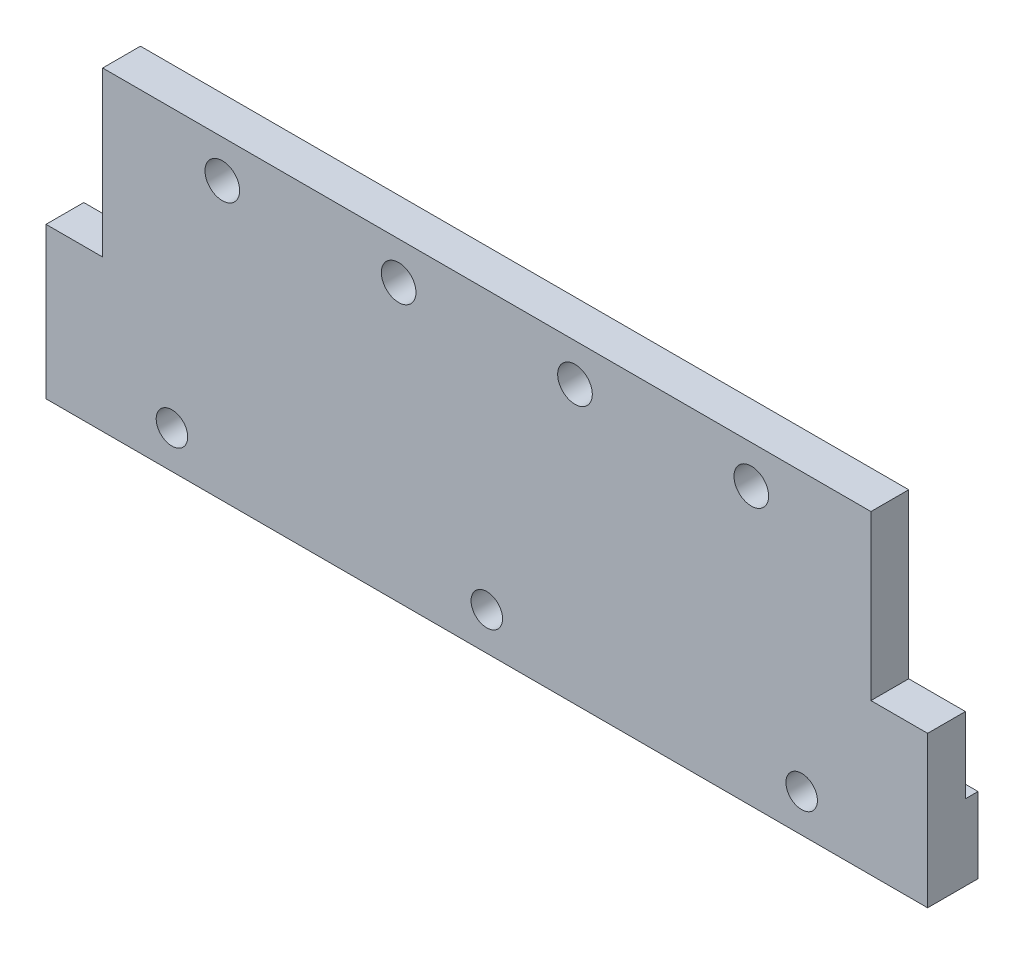
ISO-10303-21;
HEADER;
FILE_DESCRIPTION(('STEP AP214'),'2;1');
FILE_NAME('part.step','',(''),(''),'','','');
FILE_SCHEMA(('AUTOMOTIVE_DESIGN { 1 0 10303 214 1 1 1 1 }'));
ENDSEC;
DATA;
#1=APPLICATION_CONTEXT('core data for automotive mechanical design processes');
#2=APPLICATION_PROTOCOL_DEFINITION('international standard','automotive_design',2000,#1);
#3=PRODUCT_CONTEXT('',#1,'mechanical');
#4=PRODUCT('Part','Part','',(#3));
#5=PRODUCT_RELATED_PRODUCT_CATEGORY('part','',(#4));
#6=PRODUCT_DEFINITION_FORMATION('','',#4);
#7=PRODUCT_DEFINITION_CONTEXT('part definition',#1,'design');
#8=PRODUCT_DEFINITION('design','',#6,#7);
#9=PRODUCT_DEFINITION_SHAPE('','',#8);
#10=(LENGTH_UNIT() NAMED_UNIT(*) SI_UNIT(.MILLI.,.METRE.));
#11=(NAMED_UNIT(*) PLANE_ANGLE_UNIT() SI_UNIT($,.RADIAN.));
#12=(NAMED_UNIT(*) SI_UNIT($,.STERADIAN.) SOLID_ANGLE_UNIT());
#13=UNCERTAINTY_MEASURE_WITH_UNIT(LENGTH_MEASURE(1.E-05),#10,'distance_accuracy_value','');
#14=(GEOMETRIC_REPRESENTATION_CONTEXT(3) GLOBAL_UNCERTAINTY_ASSIGNED_CONTEXT((#13)) GLOBAL_UNIT_ASSIGNED_CONTEXT((#10,
#11,#12)) REPRESENTATION_CONTEXT('',''));
#15=CARTESIAN_POINT('',(0.,0.,0.));
#16=DIRECTION('',(0.,0.,1.));
#17=DIRECTION('',(1.,0.,0.));
#18=AXIS2_PLACEMENT_3D('',#15,#16,#17);
#19=CARTESIAN_POINT('',(70.,-25.,6.));
#20=DIRECTION('',(-1.,0.,0.));
#21=DIRECTION('',(0.,0.,1.));
#22=AXIS2_PLACEMENT_3D('',#19,#20,#21);
#23=PLANE('',#22);
#24=DIRECTION('',(0.,1.,0.));
#25=VECTOR('',#24,1.);
#26=CARTESIAN_POINT('',(70.,-25.,0.));
#27=LINE('',#26,#25);
#28=CARTESIAN_POINT('',(70.,-13.,0.));
#29=VERTEX_POINT('',#28);
#30=CARTESIAN_POINT('',(70.,-0.999999999999997,0.));
#31=VERTEX_POINT('',#30);
#32=EDGE_CURVE('E145',#29,#31,#27,.T.);
#33=ORIENTED_EDGE('',*,*,#32,.T.);
#34=DIRECTION('',(0.,0.,1.));
#35=VECTOR('',#34,1.);
#36=CARTESIAN_POINT('',(70.,-0.999999999999997,-2.000025));
#37=LINE('',#36,#35);
#38=CARTESIAN_POINT('',(70.,-0.999999999999997,6.));
#39=VERTEX_POINT('',#38);
#40=EDGE_CURVE('E217',#31,#39,#37,.T.);
#41=ORIENTED_EDGE('',*,*,#40,.T.);
#42=DIRECTION('',(0.,1.,0.));
#43=VECTOR('',#42,1.);
#44=CARTESIAN_POINT('',(70.,-25.,6.));
#45=LINE('',#44,#43);
#46=CARTESIAN_POINT('',(70.,-25.,6.));
#47=VERTEX_POINT('',#46);
#48=EDGE_CURVE('E130',#47,#39,#45,.T.);
#49=ORIENTED_EDGE('',*,*,#48,.F.);
#50=DIRECTION('',(0.,0.,-1.));
#51=VECTOR('',#50,1.);
#52=CARTESIAN_POINT('',(70.,-25.,6.));
#53=LINE('',#52,#51);
#54=CARTESIAN_POINT('',(70.,-25.,-2.));
#55=VERTEX_POINT('',#54);
#56=EDGE_CURVE('E139',#47,#55,#53,.T.);
#57=ORIENTED_EDGE('',*,*,#56,.T.);
#58=DIRECTION('',(0.,-1.,0.));
#59=VECTOR('',#58,1.);
#60=CARTESIAN_POINT('',(70.,-25.,-2.));
#61=LINE('',#60,#59);
#62=CARTESIAN_POINT('',(70.,-13.,-2.));
#63=VERTEX_POINT('',#62);
#64=EDGE_CURVE('E289',#63,#55,#61,.T.);
#65=ORIENTED_EDGE('',*,*,#64,.F.);
#66=DIRECTION('',(0.,0.,1.));
#67=VECTOR('',#66,1.);
#68=CARTESIAN_POINT('',(70.,-13.,-2.));
#69=LINE('',#68,#67);
#70=EDGE_CURVE('E158',#63,#29,#69,.T.);
#71=ORIENTED_EDGE('',*,*,#70,.T.);
#72=EDGE_LOOP('',(#33,#41,#49,#57,#65,#71));
#73=FACE_BOUND('',#72,.T.);
#74=ADVANCED_FACE('F34',(#73),#23,.F.);
#75=CARTESIAN_POINT('',(-70.,25.,6.));
#76=DIRECTION('',(0.,-1.,0.));
#77=DIRECTION('',(0.,0.,-1.));
#78=AXIS2_PLACEMENT_3D('',#75,#76,#77);
#79=PLANE('',#78);
#80=DIRECTION('',(-1.,0.,0.));
#81=VECTOR('',#80,1.);
#82=CARTESIAN_POINT('',(-70.,25.,6.));
#83=LINE('',#82,#81);
#84=CARTESIAN_POINT('',(61.,25.,6.));
#85=VERTEX_POINT('',#84);
#86=CARTESIAN_POINT('',(-61.,25.,6.));
#87=VERTEX_POINT('',#86);
#88=EDGE_CURVE('E122',#85,#87,#83,.T.);
#89=ORIENTED_EDGE('',*,*,#88,.F.);
#90=DIRECTION('',(0.,0.,1.));
#91=VECTOR('',#90,1.);
#92=CARTESIAN_POINT('',(61.,25.,-2.000025));
#93=LINE('',#92,#91);
#94=CARTESIAN_POINT('',(61.,25.,0.));
#95=VERTEX_POINT('',#94);
#96=EDGE_CURVE('E107',#95,#85,#93,.T.);
#97=ORIENTED_EDGE('',*,*,#96,.F.);
#98=DIRECTION('',(-1.,0.,0.));
#99=VECTOR('',#98,1.);
#100=CARTESIAN_POINT('',(-70.,25.,0.));
#101=LINE('',#100,#99);
#102=CARTESIAN_POINT('',(-61.,25.,0.));
#103=VERTEX_POINT('',#102);
#104=EDGE_CURVE('E142',#95,#103,#101,.T.);
#105=ORIENTED_EDGE('',*,*,#104,.T.);
#106=DIRECTION('',(0.,0.,1.));
#107=VECTOR('',#106,1.);
#108=CARTESIAN_POINT('',(-61.,25.,-2.000025));
#109=LINE('',#108,#107);
#110=EDGE_CURVE('E128',#103,#87,#109,.T.);
#111=ORIENTED_EDGE('',*,*,#110,.T.);
#112=EDGE_LOOP('',(#89,#97,#105,#111));
#113=FACE_BOUND('',#112,.T.);
#114=ADVANCED_FACE('F126',(#113),#79,.F.);
#115=CARTESIAN_POINT('',(-70.,-25.,6.));
#116=DIRECTION('',(1.,0.,0.));
#117=DIRECTION('',(0.,0.,-1.));
#118=AXIS2_PLACEMENT_3D('',#115,#116,#117);
#119=PLANE('',#118);
#120=DIRECTION('',(0.,-1.,0.));
#121=VECTOR('',#120,1.);
#122=CARTESIAN_POINT('',(-70.,-25.,6.));
#123=LINE('',#122,#121);
#124=CARTESIAN_POINT('',(-70.,-0.999999999999997,6.));
#125=VERTEX_POINT('',#124);
#126=CARTESIAN_POINT('',(-70.,-25.,6.));
#127=VERTEX_POINT('',#126);
#128=EDGE_CURVE('E129',#125,#127,#123,.T.);
#129=ORIENTED_EDGE('',*,*,#128,.F.);
#130=DIRECTION('',(0.,0.,1.));
#131=VECTOR('',#130,1.);
#132=CARTESIAN_POINT('',(-70.,-0.999999999999997,-2.000025));
#133=LINE('',#132,#131);
#134=CARTESIAN_POINT('',(-70.,-0.999999999999997,0.));
#135=VERTEX_POINT('',#134);
#136=EDGE_CURVE('E266',#135,#125,#133,.T.);
#137=ORIENTED_EDGE('',*,*,#136,.F.);
#138=DIRECTION('',(0.,-1.,0.));
#139=VECTOR('',#138,1.);
#140=CARTESIAN_POINT('',(-70.,-25.,0.));
#141=LINE('',#140,#139);
#142=CARTESIAN_POINT('',(-70.,-13.,0.));
#143=VERTEX_POINT('',#142);
#144=EDGE_CURVE('E134',#135,#143,#141,.T.);
#145=ORIENTED_EDGE('',*,*,#144,.T.);
#146=DIRECTION('',(0.,0.,1.));
#147=VECTOR('',#146,1.);
#148=CARTESIAN_POINT('',(-70.,-13.,-2.));
#149=LINE('',#148,#147);
#150=CARTESIAN_POINT('',(-70.,-13.,-2.));
#151=VERTEX_POINT('',#150);
#152=EDGE_CURVE('E172',#151,#143,#149,.T.);
#153=ORIENTED_EDGE('',*,*,#152,.F.);
#154=DIRECTION('',(0.,1.,0.));
#155=VECTOR('',#154,1.);
#156=CARTESIAN_POINT('',(-70.,-25.,-2.));
#157=LINE('',#156,#155);
#158=CARTESIAN_POINT('',(-70.,-25.,-2.));
#159=VERTEX_POINT('',#158);
#160=EDGE_CURVE('E156',#159,#151,#157,.T.);
#161=ORIENTED_EDGE('',*,*,#160,.F.);
#162=DIRECTION('',(0.,0.,-1.));
#163=VECTOR('',#162,1.);
#164=CARTESIAN_POINT('',(-70.,-25.,6.));
#165=LINE('',#164,#163);
#166=EDGE_CURVE('E150',#127,#159,#165,.T.);
#167=ORIENTED_EDGE('',*,*,#166,.F.);
#168=EDGE_LOOP('',(#129,#137,#145,#153,#161,#167));
#169=FACE_BOUND('',#168,.T.);
#170=ADVANCED_FACE('F213',(#169),#119,.F.);
#171=CARTESIAN_POINT('',(-70.,-25.,6.));
#172=DIRECTION('',(0.,1.,0.));
#173=DIRECTION('',(0.,0.,1.));
#174=AXIS2_PLACEMENT_3D('',#171,#172,#173);
#175=PLANE('',#174);
#176=ORIENTED_EDGE('',*,*,#166,.T.);
#177=DIRECTION('',(-1.,0.,0.));
#178=VECTOR('',#177,1.);
#179=CARTESIAN_POINT('',(-70.,-25.,-2.));
#180=LINE('',#179,#178);
#181=EDGE_CURVE('E163',#55,#159,#180,.T.);
#182=ORIENTED_EDGE('',*,*,#181,.F.);
#183=ORIENTED_EDGE('',*,*,#56,.F.);
#184=DIRECTION('',(1.,0.,0.));
#185=VECTOR('',#184,1.);
#186=CARTESIAN_POINT('',(-70.,-25.,6.));
#187=LINE('',#186,#185);
#188=EDGE_CURVE('E132',#127,#47,#187,.T.);
#189=ORIENTED_EDGE('',*,*,#188,.F.);
#190=EDGE_LOOP('',(#176,#182,#183,#189));
#191=FACE_BOUND('',#190,.T.);
#192=ADVANCED_FACE('F202',(#191),#175,.F.);
#193=CARTESIAN_POINT('',(70.,25.,6.));
#194=DIRECTION('',(0.,0.,-1.));
#195=DIRECTION('',(-1.,0.,0.));
#196=AXIS2_PLACEMENT_3D('',#193,#194,#195);
#197=PLANE('',#196);
#198=CARTESIAN_POINT('',(0.,-19.,6.));
#199=DIRECTION('',(0.,0.,1.));
#200=DIRECTION('',(1.,0.,0.));
#201=AXIS2_PLACEMENT_3D('',#198,#199,#200);
#202=CIRCLE('',#201,2.5);
#203=CARTESIAN_POINT('',(2.5,-19.,6.));
#204=VERTEX_POINT('',#203);
#205=EDGE_CURVE('E275',#204,#204,#202,.T.);
#206=ORIENTED_EDGE('',*,*,#205,.F.);
#207=EDGE_LOOP('',(#206));
#208=FACE_BOUND('',#207,.T.);
#209=CARTESIAN_POINT('',(-50.,-19.,6.));
#210=DIRECTION('',(0.,0.,1.));
#211=DIRECTION('',(1.,0.,0.));
#212=AXIS2_PLACEMENT_3D('',#209,#210,#211);
#213=CIRCLE('',#212,2.5);
#214=CARTESIAN_POINT('',(-47.5,-19.,6.));
#215=VERTEX_POINT('',#214);
#216=EDGE_CURVE('E246',#215,#215,#213,.T.);
#217=ORIENTED_EDGE('',*,*,#216,.F.);
#218=EDGE_LOOP('',(#217));
#219=FACE_BOUND('',#218,.T.);
#220=CARTESIAN_POINT('',(50.,-19.,6.));
#221=DIRECTION('',(0.,0.,1.));
#222=DIRECTION('',(1.,0.,0.));
#223=AXIS2_PLACEMENT_3D('',#220,#221,#222);
#224=CIRCLE('',#223,2.5);
#225=CARTESIAN_POINT('',(52.5,-19.,6.));
#226=VERTEX_POINT('',#225);
#227=EDGE_CURVE('E241',#226,#226,#224,.T.);
#228=ORIENTED_EDGE('',*,*,#227,.F.);
#229=EDGE_LOOP('',(#228));
#230=FACE_BOUND('',#229,.T.);
#231=CARTESIAN_POINT('',(42.,19.,6.));
#232=DIRECTION('',(0.,0.,-1.));
#233=DIRECTION('',(-1.,0.,0.));
#234=AXIS2_PLACEMENT_3D('',#231,#232,#233);
#235=CIRCLE('',#234,2.75);
#236=CARTESIAN_POINT('',(39.25,19.,6.));
#237=VERTEX_POINT('',#236);
#238=EDGE_CURVE('E165',#237,#237,#235,.T.);
#239=ORIENTED_EDGE('',*,*,#238,.T.);
#240=EDGE_LOOP('',(#239));
#241=FACE_BOUND('',#240,.T.);
#242=CARTESIAN_POINT('',(14.,19.,6.));
#243=DIRECTION('',(0.,0.,-1.));
#244=DIRECTION('',(-1.,0.,0.));
#245=AXIS2_PLACEMENT_3D('',#242,#243,#244);
#246=CIRCLE('',#245,2.75);
#247=CARTESIAN_POINT('',(11.25,19.,6.));
#248=VERTEX_POINT('',#247);
#249=EDGE_CURVE('E173',#248,#248,#246,.T.);
#250=ORIENTED_EDGE('',*,*,#249,.T.);
#251=EDGE_LOOP('',(#250));
#252=FACE_BOUND('',#251,.T.);
#253=CARTESIAN_POINT('',(-14.,19.,6.));
#254=DIRECTION('',(0.,0.,-1.));
#255=DIRECTION('',(-1.,0.,0.));
#256=AXIS2_PLACEMENT_3D('',#253,#254,#255);
#257=CIRCLE('',#256,2.75);
#258=CARTESIAN_POINT('',(-16.75,19.,6.));
#259=VERTEX_POINT('',#258);
#260=EDGE_CURVE('E179',#259,#259,#257,.T.);
#261=ORIENTED_EDGE('',*,*,#260,.T.);
#262=EDGE_LOOP('',(#261));
#263=FACE_BOUND('',#262,.T.);
#264=CARTESIAN_POINT('',(-42.,19.,6.));
#265=DIRECTION('',(0.,0.,-1.));
#266=DIRECTION('',(-1.,0.,0.));
#267=AXIS2_PLACEMENT_3D('',#264,#265,#266);
#268=CIRCLE('',#267,2.75);
#269=CARTESIAN_POINT('',(-44.75,19.,6.));
#270=VERTEX_POINT('',#269);
#271=EDGE_CURVE('E149',#270,#270,#268,.T.);
#272=ORIENTED_EDGE('',*,*,#271,.T.);
#273=EDGE_LOOP('',(#272));
#274=FACE_BOUND('',#273,.T.);
#275=ORIENTED_EDGE('',*,*,#48,.T.);
#276=DIRECTION('',(1.,0.,0.));
#277=VECTOR('',#276,1.);
#278=CARTESIAN_POINT('',(70.,-0.999999999999997,6.));
#279=LINE('',#278,#277);
#280=CARTESIAN_POINT('',(61.,-0.999999999999999,6.));
#281=VERTEX_POINT('',#280);
#282=EDGE_CURVE('E116',#281,#39,#279,.T.);
#283=ORIENTED_EDGE('',*,*,#282,.F.);
#284=DIRECTION('',(0.,-1.,0.));
#285=VECTOR('',#284,1.);
#286=CARTESIAN_POINT('',(61.,25.,6.));
#287=LINE('',#286,#285);
#288=EDGE_CURVE('E110',#85,#281,#287,.T.);
#289=ORIENTED_EDGE('',*,*,#288,.F.);
#290=ORIENTED_EDGE('',*,*,#88,.T.);
#291=DIRECTION('',(0.,1.,0.));
#292=VECTOR('',#291,1.);
#293=CARTESIAN_POINT('',(-61.,25.,6.));
#294=LINE('',#293,#292);
#295=CARTESIAN_POINT('',(-61.,-0.999999999999997,6.));
#296=VERTEX_POINT('',#295);
#297=EDGE_CURVE('E268',#296,#87,#294,.T.);
#298=ORIENTED_EDGE('',*,*,#297,.F.);
#299=DIRECTION('',(1.,0.,0.));
#300=VECTOR('',#299,1.);
#301=CARTESIAN_POINT('',(-70.,-0.999999999999997,6.));
#302=LINE('',#301,#300);
#303=EDGE_CURVE('E271',#125,#296,#302,.T.);
#304=ORIENTED_EDGE('',*,*,#303,.F.);
#305=ORIENTED_EDGE('',*,*,#128,.T.);
#306=ORIENTED_EDGE('',*,*,#188,.T.);
#307=EDGE_LOOP('',(#275,#283,#289,#290,#298,#304,#305,#306));
#308=FACE_BOUND('',#307,.T.);
#309=ADVANCED_FACE('F120',(#208,#219,#230,#241,#252,#263,#274,#308),#197,.F.);
#310=CARTESIAN_POINT('',(70.,25.,0.));
#311=DIRECTION('',(0.,0.,-1.));
#312=DIRECTION('',(-1.,0.,0.));
#313=AXIS2_PLACEMENT_3D('',#310,#311,#312);
#314=PLANE('',#313);
#315=DIRECTION('',(-1.,0.,0.));
#316=VECTOR('',#315,1.);
#317=CARTESIAN_POINT('',(70.,-0.999999999999997,0.));
#318=LINE('',#317,#316);
#319=CARTESIAN_POINT('',(61.,-0.999999999999997,0.));
#320=VERTEX_POINT('',#319);
#321=EDGE_CURVE('E11',#31,#320,#318,.T.);
#322=ORIENTED_EDGE('',*,*,#321,.F.);
#323=ORIENTED_EDGE('',*,*,#32,.F.);
#324=DIRECTION('',(1.,0.,0.));
#325=VECTOR('',#324,1.);
#326=CARTESIAN_POINT('',(-70.,-13.,0.));
#327=LINE('',#326,#325);
#328=EDGE_CURVE('E152',#143,#29,#327,.T.);
#329=ORIENTED_EDGE('',*,*,#328,.F.);
#330=ORIENTED_EDGE('',*,*,#144,.F.);
#331=DIRECTION('',(-1.,0.,0.));
#332=VECTOR('',#331,1.);
#333=CARTESIAN_POINT('',(70.,-0.999999999999997,0.));
#334=LINE('',#333,#332);
#335=CARTESIAN_POINT('',(-61.,-0.999999999999997,0.));
#336=VERTEX_POINT('',#335);
#337=EDGE_CURVE('E249',#336,#135,#334,.T.);
#338=ORIENTED_EDGE('',*,*,#337,.F.);
#339=DIRECTION('',(0.,-1.,0.));
#340=VECTOR('',#339,1.);
#341=CARTESIAN_POINT('',(-61.,25.,0.));
#342=LINE('',#341,#340);
#343=EDGE_CURVE('E259',#103,#336,#342,.T.);
#344=ORIENTED_EDGE('',*,*,#343,.F.);
#345=ORIENTED_EDGE('',*,*,#104,.F.);
#346=DIRECTION('',(0.,1.,0.));
#347=VECTOR('',#346,1.);
#348=CARTESIAN_POINT('',(61.,25.,0.));
#349=LINE('',#348,#347);
#350=EDGE_CURVE('E41',#320,#95,#349,.T.);
#351=ORIENTED_EDGE('',*,*,#350,.F.);
#352=EDGE_LOOP('',(#322,#323,#329,#330,#338,#344,#345,#351));
#353=FACE_BOUND('',#352,.T.);
#354=CARTESIAN_POINT('',(42.,19.,0.));
#355=DIRECTION('',(0.,0.,-1.));
#356=DIRECTION('',(-1.,0.,0.));
#357=AXIS2_PLACEMENT_3D('',#354,#355,#356);
#358=CIRCLE('',#357,2.75);
#359=CARTESIAN_POINT('',(39.25,19.,0.));
#360=VERTEX_POINT('',#359);
#361=EDGE_CURVE('E169',#360,#360,#358,.T.);
#362=ORIENTED_EDGE('',*,*,#361,.F.);
#363=EDGE_LOOP('',(#362));
#364=FACE_BOUND('',#363,.T.);
#365=CARTESIAN_POINT('',(14.,19.,0.));
#366=DIRECTION('',(0.,0.,-1.));
#367=DIRECTION('',(-1.,0.,0.));
#368=AXIS2_PLACEMENT_3D('',#365,#366,#367);
#369=CIRCLE('',#368,2.75);
#370=CARTESIAN_POINT('',(11.25,19.,0.));
#371=VERTEX_POINT('',#370);
#372=EDGE_CURVE('E168',#371,#371,#369,.T.);
#373=ORIENTED_EDGE('',*,*,#372,.F.);
#374=EDGE_LOOP('',(#373));
#375=FACE_BOUND('',#374,.T.);
#376=CARTESIAN_POINT('',(-14.,19.,0.));
#377=DIRECTION('',(0.,0.,-1.));
#378=DIRECTION('',(-1.,0.,0.));
#379=AXIS2_PLACEMENT_3D('',#376,#377,#378);
#380=CIRCLE('',#379,2.75);
#381=CARTESIAN_POINT('',(-16.75,19.,0.));
#382=VERTEX_POINT('',#381);
#383=EDGE_CURVE('E176',#382,#382,#380,.T.);
#384=ORIENTED_EDGE('',*,*,#383,.F.);
#385=EDGE_LOOP('',(#384));
#386=FACE_BOUND('',#385,.T.);
#387=CARTESIAN_POINT('',(-42.,19.,0.));
#388=DIRECTION('',(0.,0.,-1.));
#389=DIRECTION('',(-1.,0.,0.));
#390=AXIS2_PLACEMENT_3D('',#387,#388,#389);
#391=CIRCLE('',#390,2.75);
#392=CARTESIAN_POINT('',(-44.75,19.,0.));
#393=VERTEX_POINT('',#392);
#394=EDGE_CURVE('E182',#393,#393,#391,.T.);
#395=ORIENTED_EDGE('',*,*,#394,.F.);
#396=EDGE_LOOP('',(#395));
#397=FACE_BOUND('',#396,.T.);
#398=ADVANCED_FACE('F191',(#353,#364,#375,#386,#397),#314,.T.);
#399=CARTESIAN_POINT('',(-42.,19.,6.));
#400=DIRECTION('',(0.,0.,-1.));
#401=DIRECTION('',(-1.,0.,0.));
#402=AXIS2_PLACEMENT_3D('',#399,#400,#401);
#403=CYLINDRICAL_SURFACE('',#402,2.75);
#404=ORIENTED_EDGE('',*,*,#271,.F.);
#405=EDGE_LOOP('',(#404));
#406=FACE_BOUND('',#405,.T.);
#407=ORIENTED_EDGE('',*,*,#394,.T.);
#408=EDGE_LOOP('',(#407));
#409=FACE_BOUND('',#408,.T.);
#410=ADVANCED_FACE('F189',(#406,#409),#403,.F.);
#411=CARTESIAN_POINT('',(-14.,19.,6.));
#412=DIRECTION('',(0.,0.,-1.));
#413=DIRECTION('',(-1.,0.,0.));
#414=AXIS2_PLACEMENT_3D('',#411,#412,#413);
#415=CYLINDRICAL_SURFACE('',#414,2.75);
#416=ORIENTED_EDGE('',*,*,#260,.F.);
#417=EDGE_LOOP('',(#416));
#418=FACE_BOUND('',#417,.T.);
#419=ORIENTED_EDGE('',*,*,#383,.T.);
#420=EDGE_LOOP('',(#419));
#421=FACE_BOUND('',#420,.T.);
#422=ADVANCED_FACE('F199',(#418,#421),#415,.F.);
#423=CARTESIAN_POINT('',(14.,19.,6.));
#424=DIRECTION('',(0.,0.,-1.));
#425=DIRECTION('',(-1.,0.,0.));
#426=AXIS2_PLACEMENT_3D('',#423,#424,#425);
#427=CYLINDRICAL_SURFACE('',#426,2.75);
#428=ORIENTED_EDGE('',*,*,#249,.F.);
#429=EDGE_LOOP('',(#428));
#430=FACE_BOUND('',#429,.T.);
#431=ORIENTED_EDGE('',*,*,#372,.T.);
#432=EDGE_LOOP('',(#431));
#433=FACE_BOUND('',#432,.T.);
#434=ADVANCED_FACE('F342',(#430,#433),#427,.F.);
#435=CARTESIAN_POINT('',(42.,19.,6.));
#436=DIRECTION('',(0.,0.,-1.));
#437=DIRECTION('',(-1.,0.,0.));
#438=AXIS2_PLACEMENT_3D('',#435,#436,#437);
#439=CYLINDRICAL_SURFACE('',#438,2.75);
#440=ORIENTED_EDGE('',*,*,#238,.F.);
#441=EDGE_LOOP('',(#440));
#442=FACE_BOUND('',#441,.T.);
#443=ORIENTED_EDGE('',*,*,#361,.T.);
#444=EDGE_LOOP('',(#443));
#445=FACE_BOUND('',#444,.T.);
#446=ADVANCED_FACE('F339',(#442,#445),#439,.F.);
#447=CARTESIAN_POINT('',(-70.,-13.,-2.));
#448=DIRECTION('',(0.,-1.,0.));
#449=DIRECTION('',(1.,0.,0.));
#450=AXIS2_PLACEMENT_3D('',#447,#448,#449);
#451=PLANE('',#450);
#452=ORIENTED_EDGE('',*,*,#328,.T.);
#453=ORIENTED_EDGE('',*,*,#70,.F.);
#454=DIRECTION('',(1.,0.,0.));
#455=VECTOR('',#454,1.);
#456=CARTESIAN_POINT('',(-70.,-13.,-2.));
#457=LINE('',#456,#455);
#458=EDGE_CURVE('E226',#151,#63,#457,.T.);
#459=ORIENTED_EDGE('',*,*,#458,.F.);
#460=ORIENTED_EDGE('',*,*,#152,.T.);
#461=EDGE_LOOP('',(#452,#453,#459,#460));
#462=FACE_BOUND('',#461,.T.);
#463=ADVANCED_FACE('F224',(#462),#451,.F.);
#464=CARTESIAN_POINT('',(-70.,-13.,-2.));
#465=DIRECTION('',(0.,0.,-1.));
#466=DIRECTION('',(-1.,0.,0.));
#467=AXIS2_PLACEMENT_3D('',#464,#465,#466);
#468=PLANE('',#467);
#469=CARTESIAN_POINT('',(0.,-19.,-2.));
#470=DIRECTION('',(0.,0.,-1.));
#471=DIRECTION('',(-1.,0.,0.));
#472=AXIS2_PLACEMENT_3D('',#469,#470,#471);
#473=CIRCLE('',#472,3.249975);
#474=CARTESIAN_POINT('',(-3.249975,-19.,-2.));
#475=VERTEX_POINT('',#474);
#476=EDGE_CURVE('E243',#475,#475,#473,.T.);
#477=ORIENTED_EDGE('',*,*,#476,.F.);
#478=EDGE_LOOP('',(#477));
#479=FACE_BOUND('',#478,.T.);
#480=CARTESIAN_POINT('',(-50.,-19.,-2.));
#481=DIRECTION('',(0.,0.,-1.));
#482=DIRECTION('',(-1.,0.,0.));
#483=AXIS2_PLACEMENT_3D('',#480,#481,#482);
#484=CIRCLE('',#483,3.24997499999999);
#485=CARTESIAN_POINT('',(-53.249975,-19.,-2.));
#486=VERTEX_POINT('',#485);
#487=EDGE_CURVE('E238',#486,#486,#484,.T.);
#488=ORIENTED_EDGE('',*,*,#487,.F.);
#489=EDGE_LOOP('',(#488));
#490=FACE_BOUND('',#489,.T.);
#491=CARTESIAN_POINT('',(50.,-19.,-2.));
#492=DIRECTION('',(0.,0.,-1.));
#493=DIRECTION('',(-1.,0.,0.));
#494=AXIS2_PLACEMENT_3D('',#491,#492,#493);
#495=CIRCLE('',#494,3.24997499999999);
#496=CARTESIAN_POINT('',(46.750025,-19.,-2.));
#497=VERTEX_POINT('',#496);
#498=EDGE_CURVE('E157',#497,#497,#495,.T.);
#499=ORIENTED_EDGE('',*,*,#498,.F.);
#500=EDGE_LOOP('',(#499));
#501=FACE_BOUND('',#500,.T.);
#502=ORIENTED_EDGE('',*,*,#160,.T.);
#503=ORIENTED_EDGE('',*,*,#458,.T.);
#504=ORIENTED_EDGE('',*,*,#64,.T.);
#505=ORIENTED_EDGE('',*,*,#181,.T.);
#506=EDGE_LOOP('',(#502,#503,#504,#505));
#507=FACE_BOUND('',#506,.T.);
#508=ADVANCED_FACE('F291',(#479,#490,#501,#507),#468,.T.);
#509=CARTESIAN_POINT('',(50.,-19.,-1.250025));
#510=DIRECTION('',(0.,0.,-1.));
#511=DIRECTION('',(-1.,0.,0.));
#512=AXIS2_PLACEMENT_3D('',#509,#510,#511);
#513=CONICAL_SURFACE('',#512,2.5,0.785398163397448);
#514=ORIENTED_EDGE('',*,*,#498,.T.);
#515=EDGE_LOOP('',(#514));
#516=FACE_BOUND('',#515,.T.);
#517=CARTESIAN_POINT('',(50.,-19.,-1.250025));
#518=DIRECTION('',(0.,0.,1.));
#519=DIRECTION('',(1.,0.,0.));
#520=AXIS2_PLACEMENT_3D('',#517,#518,#519);
#521=CIRCLE('',#520,2.5);
#522=CARTESIAN_POINT('',(52.5,-19.,-1.250025));
#523=VERTEX_POINT('',#522);
#524=EDGE_CURVE('E237',#523,#523,#521,.T.);
#525=ORIENTED_EDGE('',*,*,#524,.T.);
#526=EDGE_LOOP('',(#525));
#527=FACE_BOUND('',#526,.T.);
#528=ADVANCED_FACE('F329',(#516,#527),#513,.F.);
#529=CARTESIAN_POINT('',(50.,-19.,6.));
#530=DIRECTION('',(0.,0.,1.));
#531=DIRECTION('',(1.,0.,0.));
#532=AXIS2_PLACEMENT_3D('',#529,#530,#531);
#533=CYLINDRICAL_SURFACE('',#532,2.5);
#534=ORIENTED_EDGE('',*,*,#524,.F.);
#535=EDGE_LOOP('',(#534));
#536=FACE_BOUND('',#535,.T.);
#537=ORIENTED_EDGE('',*,*,#227,.T.);
#538=EDGE_LOOP('',(#537));
#539=FACE_BOUND('',#538,.T.);
#540=ADVANCED_FACE('F325',(#536,#539),#533,.F.);
#541=CARTESIAN_POINT('',(-50.,-19.,-1.250025));
#542=DIRECTION('',(0.,0.,-1.));
#543=DIRECTION('',(-1.,0.,0.));
#544=AXIS2_PLACEMENT_3D('',#541,#542,#543);
#545=CONICAL_SURFACE('',#544,2.5,0.785398163397448);
#546=ORIENTED_EDGE('',*,*,#487,.T.);
#547=EDGE_LOOP('',(#546));
#548=FACE_BOUND('',#547,.T.);
#549=CARTESIAN_POINT('',(-50.,-19.,-1.250025));
#550=DIRECTION('',(0.,0.,1.));
#551=DIRECTION('',(1.,0.,0.));
#552=AXIS2_PLACEMENT_3D('',#549,#550,#551);
#553=CIRCLE('',#552,2.5);
#554=CARTESIAN_POINT('',(-47.5,-19.,-1.250025));
#555=VERTEX_POINT('',#554);
#556=EDGE_CURVE('E242',#555,#555,#553,.T.);
#557=ORIENTED_EDGE('',*,*,#556,.T.);
#558=EDGE_LOOP('',(#557));
#559=FACE_BOUND('',#558,.T.);
#560=ADVANCED_FACE('F321',(#548,#559),#545,.F.);
#561=CARTESIAN_POINT('',(-50.,-19.,6.));
#562=DIRECTION('',(0.,0.,1.));
#563=DIRECTION('',(1.,0.,0.));
#564=AXIS2_PLACEMENT_3D('',#561,#562,#563);
#565=CYLINDRICAL_SURFACE('',#564,2.5);
#566=ORIENTED_EDGE('',*,*,#556,.F.);
#567=EDGE_LOOP('',(#566));
#568=FACE_BOUND('',#567,.T.);
#569=ORIENTED_EDGE('',*,*,#216,.T.);
#570=EDGE_LOOP('',(#569));
#571=FACE_BOUND('',#570,.T.);
#572=ADVANCED_FACE('F317',(#568,#571),#565,.F.);
#573=CARTESIAN_POINT('',(0.,-19.,-1.250025));
#574=DIRECTION('',(0.,0.,-1.));
#575=DIRECTION('',(-1.,0.,0.));
#576=AXIS2_PLACEMENT_3D('',#573,#574,#575);
#577=CONICAL_SURFACE('',#576,2.5,0.785398163397448);
#578=ORIENTED_EDGE('',*,*,#476,.T.);
#579=EDGE_LOOP('',(#578));
#580=FACE_BOUND('',#579,.T.);
#581=CARTESIAN_POINT('',(0.,-19.,-1.250025));
#582=DIRECTION('',(0.,0.,1.));
#583=DIRECTION('',(1.,0.,0.));
#584=AXIS2_PLACEMENT_3D('',#581,#582,#583);
#585=CIRCLE('',#584,2.5);
#586=CARTESIAN_POINT('',(2.5,-19.,-1.250025));
#587=VERTEX_POINT('',#586);
#588=EDGE_CURVE('E247',#587,#587,#585,.T.);
#589=ORIENTED_EDGE('',*,*,#588,.T.);
#590=EDGE_LOOP('',(#589));
#591=FACE_BOUND('',#590,.T.);
#592=ADVANCED_FACE('F313',(#580,#591),#577,.F.);
#593=CARTESIAN_POINT('',(0.,-19.,6.));
#594=DIRECTION('',(0.,0.,1.));
#595=DIRECTION('',(1.,0.,0.));
#596=AXIS2_PLACEMENT_3D('',#593,#594,#595);
#597=CYLINDRICAL_SURFACE('',#596,2.5);
#598=ORIENTED_EDGE('',*,*,#588,.F.);
#599=EDGE_LOOP('',(#598));
#600=FACE_BOUND('',#599,.T.);
#601=ORIENTED_EDGE('',*,*,#205,.T.);
#602=EDGE_LOOP('',(#601));
#603=FACE_BOUND('',#602,.T.);
#604=ADVANCED_FACE('F309',(#600,#603),#597,.F.);
#605=CARTESIAN_POINT('',(-61.,25.,-2.000025));
#606=DIRECTION('',(1.,0.,0.));
#607=DIRECTION('',(0.,0.,-1.));
#608=AXIS2_PLACEMENT_3D('',#605,#606,#607);
#609=PLANE('',#608);
#610=ORIENTED_EDGE('',*,*,#343,.T.);
#611=DIRECTION('',(0.,0.,1.));
#612=VECTOR('',#611,1.);
#613=CARTESIAN_POINT('',(-61.,-0.999999999999997,-2.000025));
#614=LINE('',#613,#612);
#615=EDGE_CURVE('E55',#336,#296,#614,.T.);
#616=ORIENTED_EDGE('',*,*,#615,.T.);
#617=ORIENTED_EDGE('',*,*,#297,.T.);
#618=ORIENTED_EDGE('',*,*,#110,.F.);
#619=EDGE_LOOP('',(#610,#616,#617,#618));
#620=FACE_BOUND('',#619,.T.);
#621=ADVANCED_FACE('F264',(#620),#609,.F.);
#622=CARTESIAN_POINT('',(-70.,-0.999999999999997,-2.000025));
#623=DIRECTION('',(0.,-1.,0.));
#624=DIRECTION('',(0.,0.,-1.));
#625=AXIS2_PLACEMENT_3D('',#622,#623,#624);
#626=PLANE('',#625);
#627=ORIENTED_EDGE('',*,*,#337,.T.);
#628=ORIENTED_EDGE('',*,*,#136,.T.);
#629=ORIENTED_EDGE('',*,*,#303,.T.);
#630=ORIENTED_EDGE('',*,*,#615,.F.);
#631=EDGE_LOOP('',(#627,#628,#629,#630));
#632=FACE_BOUND('',#631,.T.);
#633=ADVANCED_FACE('F299',(#632),#626,.F.);
#634=CARTESIAN_POINT('',(70.,-0.999999999999997,-2.000025));
#635=DIRECTION('',(0.,-1.,0.));
#636=DIRECTION('',(1.,0.,0.));
#637=AXIS2_PLACEMENT_3D('',#634,#635,#636);
#638=PLANE('',#637);
#639=ORIENTED_EDGE('',*,*,#321,.T.);
#640=DIRECTION('',(0.,0.,1.));
#641=VECTOR('',#640,1.);
#642=CARTESIAN_POINT('',(61.,-0.999999999999999,-2.000025));
#643=LINE('',#642,#641);
#644=EDGE_CURVE('E48',#320,#281,#643,.T.);
#645=ORIENTED_EDGE('',*,*,#644,.T.);
#646=ORIENTED_EDGE('',*,*,#282,.T.);
#647=ORIENTED_EDGE('',*,*,#40,.F.);
#648=EDGE_LOOP('',(#639,#645,#646,#647));
#649=FACE_BOUND('',#648,.T.);
#650=ADVANCED_FACE('F297',(#649),#638,.F.);
#651=CARTESIAN_POINT('',(61.,25.,-2.000025));
#652=DIRECTION('',(-1.,0.,0.));
#653=DIRECTION('',(0.,0.,1.));
#654=AXIS2_PLACEMENT_3D('',#651,#652,#653);
#655=PLANE('',#654);
#656=ORIENTED_EDGE('',*,*,#350,.T.);
#657=ORIENTED_EDGE('',*,*,#96,.T.);
#658=ORIENTED_EDGE('',*,*,#288,.T.);
#659=ORIENTED_EDGE('',*,*,#644,.F.);
#660=EDGE_LOOP('',(#656,#657,#658,#659));
#661=FACE_BOUND('',#660,.T.);
#662=ADVANCED_FACE('F109',(#661),#655,.F.);
#663=CLOSED_SHELL('',(#74,#114,#170,#192,#309,#398,#410,#422,#434,#446,#463,#508,#528,#540,#560,
#572,#592,#604,#621,#633,#650,#662));
#664=MANIFOLD_SOLID_BREP('B2',#663);
#665=ADVANCED_BREP_SHAPE_REPRESENTATION('',(#18,#664),#14);
#666=SHAPE_DEFINITION_REPRESENTATION(#9,#665);
ENDSEC;
END-ISO-10303-21;
